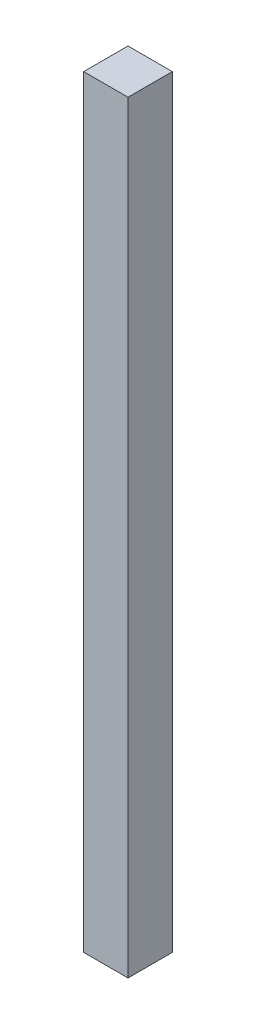
ISO-10303-21;
HEADER;
FILE_DESCRIPTION(('STEP AP214'),'2;1');
FILE_NAME('part.step','',(''),(''),'','','');
FILE_SCHEMA(('AUTOMOTIVE_DESIGN { 1 0 10303 214 1 1 1 1 }'));
ENDSEC;
DATA;
#1=APPLICATION_CONTEXT('core data for automotive mechanical design processes');
#2=APPLICATION_PROTOCOL_DEFINITION('international standard','automotive_design',2000,#1);
#3=PRODUCT_CONTEXT('',#1,'mechanical');
#4=PRODUCT('Part','Part','',(#3));
#5=PRODUCT_RELATED_PRODUCT_CATEGORY('part','',(#4));
#6=PRODUCT_DEFINITION_FORMATION('','',#4);
#7=PRODUCT_DEFINITION_CONTEXT('part definition',#1,'design');
#8=PRODUCT_DEFINITION('design','',#6,#7);
#9=PRODUCT_DEFINITION_SHAPE('','',#8);
#10=(LENGTH_UNIT() NAMED_UNIT(*) SI_UNIT(.MILLI.,.METRE.));
#11=(NAMED_UNIT(*) PLANE_ANGLE_UNIT() SI_UNIT($,.RADIAN.));
#12=(NAMED_UNIT(*) SI_UNIT($,.STERADIAN.) SOLID_ANGLE_UNIT());
#13=UNCERTAINTY_MEASURE_WITH_UNIT(LENGTH_MEASURE(1.E-05),#10,'distance_accuracy_value','');
#14=(GEOMETRIC_REPRESENTATION_CONTEXT(3) GLOBAL_UNCERTAINTY_ASSIGNED_CONTEXT((#13)) GLOBAL_UNIT_ASSIGNED_CONTEXT((#10,
#11,#12)) REPRESENTATION_CONTEXT('',''));
#15=CARTESIAN_POINT('',(0.,0.,0.));
#16=DIRECTION('',(0.,0.,1.));
#17=DIRECTION('',(1.,0.,0.));
#18=AXIS2_PLACEMENT_3D('',#15,#16,#17);
#19=CARTESIAN_POINT('',(-7.5,258.,-7.5));
#20=DIRECTION('',(1.,0.,0.));
#21=DIRECTION('',(0.,0.,-1.));
#22=AXIS2_PLACEMENT_3D('',#19,#20,#21);
#23=PLANE('',#22);
#24=DIRECTION('',(0.,0.,1.));
#25=VECTOR('',#24,1.);
#26=CARTESIAN_POINT('',(-7.5,0.,-7.5));
#27=LINE('',#26,#25);
#28=CARTESIAN_POINT('',(-7.5,0.,-7.5));
#29=VERTEX_POINT('',#28);
#30=CARTESIAN_POINT('',(-7.5,0.,7.5));
#31=VERTEX_POINT('',#30);
#32=EDGE_CURVE('E95',#29,#31,#27,.T.);
#33=ORIENTED_EDGE('',*,*,#32,.T.);
#34=DIRECTION('',(0.,-1.,0.));
#35=VECTOR('',#34,1.);
#36=CARTESIAN_POINT('',(-7.5,258.,7.5));
#37=LINE('',#36,#35);
#38=CARTESIAN_POINT('',(-7.5,258.,7.5));
#39=VERTEX_POINT('',#38);
#40=EDGE_CURVE('E11',#39,#31,#37,.T.);
#41=ORIENTED_EDGE('',*,*,#40,.F.);
#42=DIRECTION('',(0.,0.,1.));
#43=VECTOR('',#42,1.);
#44=CARTESIAN_POINT('',(-7.5,258.,-7.5));
#45=LINE('',#44,#43);
#46=CARTESIAN_POINT('',(-7.5,258.,-7.5));
#47=VERTEX_POINT('',#46);
#48=EDGE_CURVE('E83',#47,#39,#45,.T.);
#49=ORIENTED_EDGE('',*,*,#48,.F.);
#50=DIRECTION('',(0.,-1.,0.));
#51=VECTOR('',#50,1.);
#52=CARTESIAN_POINT('',(-7.5,258.,-7.5));
#53=LINE('',#52,#51);
#54=EDGE_CURVE('E91',#47,#29,#53,.T.);
#55=ORIENTED_EDGE('',*,*,#54,.T.);
#56=EDGE_LOOP('',(#33,#41,#49,#55));
#57=FACE_BOUND('',#56,.T.);
#58=ADVANCED_FACE('F32',(#57),#23,.F.);
#59=CARTESIAN_POINT('',(7.5,258.,7.5));
#60=DIRECTION('',(0.,0.,-1.));
#61=DIRECTION('',(-1.,0.,0.));
#62=AXIS2_PLACEMENT_3D('',#59,#60,#61);
#63=PLANE('',#62);
#64=DIRECTION('',(1.,0.,0.));
#65=VECTOR('',#64,1.);
#66=CARTESIAN_POINT('',(7.5,0.,7.5));
#67=LINE('',#66,#65);
#68=CARTESIAN_POINT('',(7.5,0.,7.5));
#69=VERTEX_POINT('',#68);
#70=EDGE_CURVE('E87',#31,#69,#67,.T.);
#71=ORIENTED_EDGE('',*,*,#70,.T.);
#72=DIRECTION('',(0.,-1.,0.));
#73=VECTOR('',#72,1.);
#74=CARTESIAN_POINT('',(7.5,258.,7.5));
#75=LINE('',#74,#73);
#76=CARTESIAN_POINT('',(7.5,258.,7.5));
#77=VERTEX_POINT('',#76);
#78=EDGE_CURVE('E40',#77,#69,#75,.T.);
#79=ORIENTED_EDGE('',*,*,#78,.F.);
#80=DIRECTION('',(1.,0.,0.));
#81=VECTOR('',#80,1.);
#82=CARTESIAN_POINT('',(7.5,258.,7.5));
#83=LINE('',#82,#81);
#84=EDGE_CURVE('E78',#39,#77,#83,.T.);
#85=ORIENTED_EDGE('',*,*,#84,.F.);
#86=ORIENTED_EDGE('',*,*,#40,.T.);
#87=EDGE_LOOP('',(#71,#79,#85,#86));
#88=FACE_BOUND('',#87,.T.);
#89=ADVANCED_FACE('F86',(#88),#63,.F.);
#90=CARTESIAN_POINT('',(7.5,258.,-7.5));
#91=DIRECTION('',(-1.,0.,0.));
#92=DIRECTION('',(0.,0.,1.));
#93=AXIS2_PLACEMENT_3D('',#90,#91,#92);
#94=PLANE('',#93);
#95=DIRECTION('',(0.,0.,-1.));
#96=VECTOR('',#95,1.);
#97=CARTESIAN_POINT('',(7.5,0.,-7.5));
#98=LINE('',#97,#96);
#99=CARTESIAN_POINT('',(7.5,0.,-7.5));
#100=VERTEX_POINT('',#99);
#101=EDGE_CURVE('E65',#69,#100,#98,.T.);
#102=ORIENTED_EDGE('',*,*,#101,.T.);
#103=DIRECTION('',(0.,-1.,0.));
#104=VECTOR('',#103,1.);
#105=CARTESIAN_POINT('',(7.5,258.,-7.5));
#106=LINE('',#105,#104);
#107=CARTESIAN_POINT('',(7.5,258.,-7.5));
#108=VERTEX_POINT('',#107);
#109=EDGE_CURVE('E88',#108,#100,#106,.T.);
#110=ORIENTED_EDGE('',*,*,#109,.F.);
#111=DIRECTION('',(0.,0.,-1.));
#112=VECTOR('',#111,1.);
#113=CARTESIAN_POINT('',(7.5,258.,-7.5));
#114=LINE('',#113,#112);
#115=EDGE_CURVE('E81',#77,#108,#114,.T.);
#116=ORIENTED_EDGE('',*,*,#115,.F.);
#117=ORIENTED_EDGE('',*,*,#78,.T.);
#118=EDGE_LOOP('',(#102,#110,#116,#117));
#119=FACE_BOUND('',#118,.T.);
#120=ADVANCED_FACE('F89',(#119),#94,.F.);
#121=CARTESIAN_POINT('',(7.5,258.,-7.5));
#122=DIRECTION('',(0.,0.,1.));
#123=DIRECTION('',(1.,0.,0.));
#124=AXIS2_PLACEMENT_3D('',#121,#122,#123);
#125=PLANE('',#124);
#126=DIRECTION('',(-1.,0.,0.));
#127=VECTOR('',#126,1.);
#128=CARTESIAN_POINT('',(7.5,0.,-7.5));
#129=LINE('',#128,#127);
#130=EDGE_CURVE('E71',#100,#29,#129,.T.);
#131=ORIENTED_EDGE('',*,*,#130,.T.);
#132=ORIENTED_EDGE('',*,*,#54,.F.);
#133=DIRECTION('',(-1.,0.,0.));
#134=VECTOR('',#133,1.);
#135=CARTESIAN_POINT('',(7.5,258.,-7.5));
#136=LINE('',#135,#134);
#137=EDGE_CURVE('E48',#108,#47,#136,.T.);
#138=ORIENTED_EDGE('',*,*,#137,.F.);
#139=ORIENTED_EDGE('',*,*,#109,.T.);
#140=EDGE_LOOP('',(#131,#132,#138,#139));
#141=FACE_BOUND('',#140,.T.);
#142=ADVANCED_FACE('F102',(#141),#125,.F.);
#143=CARTESIAN_POINT('',(0.,258.,0.));
#144=DIRECTION('',(0.,-1.,0.));
#145=DIRECTION('',(0.,0.,-1.));
#146=AXIS2_PLACEMENT_3D('',#143,#144,#145);
#147=PLANE('',#146);
#148=ORIENTED_EDGE('',*,*,#48,.T.);
#149=ORIENTED_EDGE('',*,*,#84,.T.);
#150=ORIENTED_EDGE('',*,*,#115,.T.);
#151=ORIENTED_EDGE('',*,*,#137,.T.);
#152=EDGE_LOOP('',(#148,#149,#150,#151));
#153=FACE_BOUND('',#152,.T.);
#154=ADVANCED_FACE('F79',(#153),#147,.F.);
#155=CARTESIAN_POINT('',(0.,0.,0.));
#156=DIRECTION('',(0.,-1.,0.));
#157=DIRECTION('',(0.,0.,-1.));
#158=AXIS2_PLACEMENT_3D('',#155,#156,#157);
#159=PLANE('',#158);
#160=ORIENTED_EDGE('',*,*,#32,.F.);
#161=ORIENTED_EDGE('',*,*,#130,.F.);
#162=ORIENTED_EDGE('',*,*,#101,.F.);
#163=ORIENTED_EDGE('',*,*,#70,.F.);
#164=EDGE_LOOP('',(#160,#161,#162,#163));
#165=FACE_BOUND('',#164,.T.);
#166=ADVANCED_FACE('F105',(#165),#159,.T.);
#167=CLOSED_SHELL('',(#58,#89,#120,#142,#154,#166));
#168=MANIFOLD_SOLID_BREP('B2',#167);
#169=ADVANCED_BREP_SHAPE_REPRESENTATION('',(#18,#168),#14);
#170=SHAPE_DEFINITION_REPRESENTATION(#9,#169);
ENDSEC;
END-ISO-10303-21;
